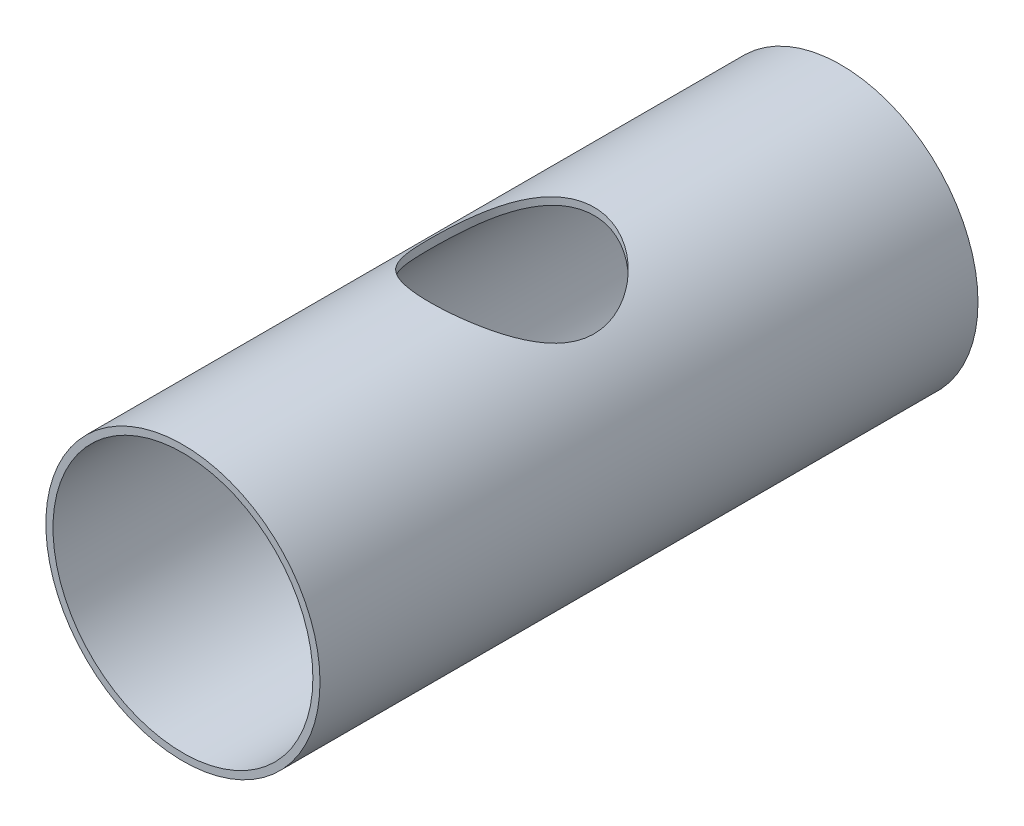
ISO-10303-21;
HEADER;
FILE_DESCRIPTION(('STEP AP214'),'2;1');
FILE_NAME('part.step','',(''),(''),'','','');
FILE_SCHEMA(('AUTOMOTIVE_DESIGN { 1 0 10303 214 1 1 1 1 }'));
ENDSEC;
DATA;
#1=APPLICATION_CONTEXT('core data for automotive mechanical design processes');
#2=APPLICATION_PROTOCOL_DEFINITION('international standard','automotive_design',2000,#1);
#3=PRODUCT_CONTEXT('',#1,'mechanical');
#4=PRODUCT('Part','Part','',(#3));
#5=PRODUCT_RELATED_PRODUCT_CATEGORY('part','',(#4));
#6=PRODUCT_DEFINITION_FORMATION('','',#4);
#7=PRODUCT_DEFINITION_CONTEXT('part definition',#1,'design');
#8=PRODUCT_DEFINITION('design','',#6,#7);
#9=PRODUCT_DEFINITION_SHAPE('','',#8);
#10=(LENGTH_UNIT() NAMED_UNIT(*) SI_UNIT(.MILLI.,.METRE.));
#11=(NAMED_UNIT(*) PLANE_ANGLE_UNIT() SI_UNIT($,.RADIAN.));
#12=(NAMED_UNIT(*) SI_UNIT($,.STERADIAN.) SOLID_ANGLE_UNIT());
#13=UNCERTAINTY_MEASURE_WITH_UNIT(LENGTH_MEASURE(1.E-05),#10,'distance_accuracy_value','');
#14=(GEOMETRIC_REPRESENTATION_CONTEXT(3) GLOBAL_UNCERTAINTY_ASSIGNED_CONTEXT((#13)) GLOBAL_UNIT_ASSIGNED_CONTEXT((#10,
#11,#12)) REPRESENTATION_CONTEXT('',''));
#15=CARTESIAN_POINT('',(0.,0.,0.));
#16=DIRECTION('',(0.,0.,1.));
#17=DIRECTION('',(1.,0.,0.));
#18=AXIS2_PLACEMENT_3D('',#15,#16,#17);
#19=CARTESIAN_POINT('',(0.,0.,0.));
#20=DIRECTION('',(0.,0.,1.));
#21=DIRECTION('',(1.,0.,0.));
#22=AXIS2_PLACEMENT_3D('',#19,#20,#21);
#23=CYLINDRICAL_SURFACE('',#22,30.099);
#24=CARTESIAN_POINT('',(0.,0.,0.));
#25=DIRECTION('',(0.,0.,1.));
#26=DIRECTION('',(1.,0.,0.));
#27=AXIS2_PLACEMENT_3D('',#24,#25,#26);
#28=CIRCLE('',#27,30.099);
#29=CARTESIAN_POINT('',(30.099,0.,0.));
#30=VERTEX_POINT('',#29);
#31=EDGE_CURVE('E53',#30,#30,#28,.T.);
#32=ORIENTED_EDGE('',*,*,#31,.F.);
#33=EDGE_LOOP('',(#32));
#34=FACE_BOUND('',#33,.T.);
#35=CARTESIAN_POINT('',(-19.05,23.3033753134605,76.2));
#36=CARTESIAN_POINT('',(-19.0499964286924,23.3033811096579,76.6720435458902));
#37=CARTESIAN_POINT('',(-19.0324211372841,23.3177796485911,77.1441439223114));
#38=CARTESIAN_POINT('',(-18.9624498991082,23.3747141684592,78.0842434430483));
#39=CARTESIAN_POINT('',(-18.9100351542867,23.4172653394344,78.5522402350307));
#40=CARTESIAN_POINT('',(-18.7712148429126,23.5286887195718,79.4810003771917));
#41=CARTESIAN_POINT('',(-18.6847351836268,23.5976182935843,79.9417456679059));
#42=CARTESIAN_POINT('',(-18.4792431160487,23.7588798978588,80.8516277262143));
#43=CARTESIAN_POINT('',(-18.3602335385331,23.8512098917487,81.3007655001823));
#44=CARTESIAN_POINT('',(-18.0925388847279,24.0548919093312,82.1809942461394));
#45=CARTESIAN_POINT('',(-17.9441296839205,24.16606580454,82.6122109946506));
#46=CARTESIAN_POINT('',(-17.6185656699363,24.4044386521597,83.4590983494921));
#47=CARTESIAN_POINT('',(-17.4414066282712,24.5316399612449,83.8747666578958));
#48=CARTESIAN_POINT('',(-17.0598732510647,24.7984815741484,84.6891340683467));
#49=CARTESIAN_POINT('',(-16.8555036749214,24.9381197012303,85.0878361219068));
#50=CARTESIAN_POINT('',(-16.4208141852716,25.2264681438916,85.8673968238354));
#51=CARTESIAN_POINT('',(-16.1904927071825,25.3751790061978,86.2482543944377));
#52=CARTESIAN_POINT('',(-15.6714656758414,25.6994366551252,87.0426374919245));
#53=CARTESIAN_POINT('',(-15.3790897113264,25.8758537957221,87.4534132828229));
#54=CARTESIAN_POINT('',(-14.7635061022875,26.2319490904412,88.2496748734941));
#55=CARTESIAN_POINT('',(-14.4402964745316,26.4116274537237,88.635159043806));
#56=CARTESIAN_POINT('',(-13.7639347985054,26.7703294712885,89.3799017296586));
#57=CARTESIAN_POINT('',(-13.4107581635878,26.9493524597719,89.7391382515408));
#58=CARTESIAN_POINT('',(-12.6757931980663,27.3027538777893,90.4295822457694));
#59=CARTESIAN_POINT('',(-12.2940031784151,27.4771320323141,90.7607880610029));
#60=CARTESIAN_POINT('',(-11.4534348202648,27.8388808198039,91.4330568536948));
#61=CARTESIAN_POINT('',(-10.9910012644315,28.0251461342588,91.770165637626));
#62=CARTESIAN_POINT('',(-10.0333435426301,28.3820885917296,92.4038319929742));
#63=CARTESIAN_POINT('',(-9.5381159482412,28.5527641004722,92.7003853145947));
#64=CARTESIAN_POINT('',(-8.51791666418115,28.8735268344577,93.2494237247363));
#65=CARTESIAN_POINT('',(-7.9929680844138,29.0236297537365,93.5019424460616));
#66=CARTESIAN_POINT('',(-6.91654377805485,29.2987986944928,93.9596669877427));
#67=CARTESIAN_POINT('',(-6.36507305357348,29.4238694142862,94.1648816877317));
#68=CARTESIAN_POINT('',(-5.2984798575911,29.6334268689036,94.505978039931));
#69=CARTESIAN_POINT('',(-4.78551094288429,29.7207757862651,94.6468401457226));
#70=CARTESIAN_POINT('',(-3.74597713522144,29.869600241993,94.8856754058247));
#71=CARTESIAN_POINT('',(-3.21941309676931,29.9310774023136,94.9836512487797));
#72=CARTESIAN_POINT('',(-2.15790631094233,30.0262711064919,95.1349706269843));
#73=CARTESIAN_POINT('',(-1.62297160754452,30.0600128121571,95.1883546170029));
#74=CARTESIAN_POINT('',(-0.54948910942336,30.0987738982047,95.2496581394133));
#75=CARTESIAN_POINT('',(-0.0109417547668578,30.1037967155155,95.2575831121058));
#76=CARTESIAN_POINT('',(0.990244783798888,30.0862821371761,95.2299005137296));
#77=CARTESIAN_POINT('',(1.4531248112464,30.0674446012371,95.200137197032));
#78=CARTESIAN_POINT('',(2.37412115481649,30.0087685977492,95.1071469094217));
#79=CARTESIAN_POINT('',(2.83223801458744,29.968932554321,95.0439238011883));
#80=CARTESIAN_POINT('',(3.74054000559729,29.8691639490416,94.8848463508602));
#81=CARTESIAN_POINT('',(4.19072481141623,29.8092305646893,94.788990673247));
#82=CARTESIAN_POINT('',(5.08026831205507,29.6705802160046,94.5658288569096));
#83=CARTESIAN_POINT('',(5.51962654739728,29.5918624559762,94.4385213858963));
#84=CARTESIAN_POINT('',(6.38555098588612,29.4171703467752,94.1536980587));
#85=CARTESIAN_POINT('',(6.8120994338097,29.3211732287649,93.9961423262216));
#86=CARTESIAN_POINT('',(7.64966554255798,29.113889514145,93.6525080559975));
#87=CARTESIAN_POINT('',(8.06068340803638,29.0026031190989,93.4664298942687));
#88=CARTESIAN_POINT('',(8.86549194668315,28.766798746861,93.067344990583));
#89=CARTESIAN_POINT('',(9.25928144231839,28.642279867237,92.8543364118311));
#90=CARTESIAN_POINT('',(10.028246699608,28.3821926176968,92.4029498148767));
#91=CARTESIAN_POINT('',(10.40342038548,28.2466230199888,92.1645689767836));
#92=CARTESIAN_POINT('',(11.1800151037953,27.9490790761088,91.6323802341892));
#93=CARTESIAN_POINT('',(11.5787952042619,27.7859291089016,91.3353725015932));
#94=CARTESIAN_POINT('',(12.3500239248784,27.4518371302508,90.7129261864017));
#95=CARTESIAN_POINT('',(12.7224706534113,27.2808945604852,90.38748556512));
#96=CARTESIAN_POINT('',(13.4404258796066,26.934435829275,89.7093165150629));
#97=CARTESIAN_POINT('',(13.7858963307524,26.758913657995,89.3565508955938));
#98=CARTESIAN_POINT('',(14.448288071092,26.4071472753367,88.6254902889073));
#99=CARTESIAN_POINT('',(14.7652079459559,26.2309030286401,88.247194038583));
#100=CARTESIAN_POINT('',(15.4103339062582,25.8578490947492,87.4133121177501));
#101=CARTESIAN_POINT('',(15.7342552937249,25.6614869478261,86.9541977396843));
#102=CARTESIAN_POINT('',(16.342014764231,25.2787928239379,86.0060284063711));
#103=CARTESIAN_POINT('',(16.6258450205764,25.0924628098533,85.516967631551));
#104=CARTESIAN_POINT('',(17.1506240797184,24.7367388622229,84.5114224206472));
#105=CARTESIAN_POINT('',(17.3916358121512,24.5673202375927,83.9949797024232));
#106=CARTESIAN_POINT('',(17.8283743125202,24.2522464416436,82.9363962503076));
#107=CARTESIAN_POINT('',(18.0241208387135,24.1065809103199,82.3942668536324));
#108=CARTESIAN_POINT('',(18.3212470844933,23.881092121581,81.4358777391786));
#109=CARTESIAN_POINT('',(18.4338616133664,23.7940809956612,81.0247631532689));
#110=CARTESIAN_POINT('',(18.6318453565921,23.639373135442,80.1924567514692));
#111=CARTESIAN_POINT('',(18.7172190042562,23.5716732585278,79.7712665873333));
#112=CARTESIAN_POINT('',(18.859480100837,23.4580076706048,78.9217203565746));
#113=CARTESIAN_POINT('',(18.9164024520992,23.4120153339661,78.4933737393401));
#114=CARTESIAN_POINT('',(19.0010372336403,23.3433797745503,77.6319138573384));
#115=CARTESIAN_POINT('',(19.0287492595379,23.3207368750179,77.1988005266657));
#116=CARTESIAN_POINT('',(19.054526988174,23.2996800503784,76.3299472405899));
#117=CARTESIAN_POINT('',(19.0525140406314,23.3013304035481,75.8942033673653));
#118=CARTESIAN_POINT('',(19.0186853972974,23.3289492165018,75.0246574232265));
#119=CARTESIAN_POINT('',(18.986869535715,23.3549178115662,74.590855363128));
#120=CARTESIAN_POINT('',(18.8939372678199,23.4301618600023,73.7281550451951));
#121=CARTESIAN_POINT('',(18.8327997515817,23.4794541047335,73.2992605486563));
#122=CARTESIAN_POINT('',(18.6821555325241,23.5994937813449,72.4495643646723));
#123=CARTESIAN_POINT('',(18.5926481631025,23.6702417173647,72.0287628676337));
#124=CARTESIAN_POINT('',(18.388770079443,23.8289574237033,71.206915303451));
#125=CARTESIAN_POINT('',(18.2749996169301,23.9165050999748,70.8056379073538));
#126=CARTESIAN_POINT('',(18.022655349524,24.1072332794926,70.0146278996121));
#127=CARTESIAN_POINT('',(17.8840717692126,24.2104199414317,69.6248999087744));
#128=CARTESIAN_POINT('',(17.583332854521,24.4297117736263,68.8584478624991));
#129=CARTESIAN_POINT('',(17.4211785086641,24.5458164020734,68.481723262538));
#130=CARTESIAN_POINT('',(17.0743815818836,24.788305035742,67.7421729405572));
#131=CARTESIAN_POINT('',(16.889736017595,24.9146904039199,67.3793490708196));
#132=CARTESIAN_POINT('',(16.4612088452912,25.2003345228271,66.5997223936424));
#133=CARTESIAN_POINT('',(16.2127726627587,25.361229950127,66.1860173304886));
#134=CARTESIAN_POINT('',(15.686700080151,25.6899487113834,65.380508673736));
#135=CARTESIAN_POINT('',(15.4090609892964,25.8577726828746,64.9887071034454));
#136=CARTESIAN_POINT('',(14.825488634821,26.1967296498121,64.2276346607233));
#137=CARTESIAN_POINT('',(14.5195289306607,26.3678656170798,63.8583853881975));
#138=CARTESIAN_POINT('',(13.880557218281,26.7097597135681,63.1438763909316));
#139=CARTESIAN_POINT('',(13.5475434255937,26.8805178171007,62.7986182514204));
#140=CARTESIAN_POINT('',(12.7962561398225,27.2471805743538,62.0764668621553));
#141=CARTESIAN_POINT('',(12.3731357009786,27.442398189211,61.7042440002966));
#142=CARTESIAN_POINT('',(11.4926798845175,27.8226183261844,60.9967181964356));
#143=CARTESIAN_POINT('',(11.035340329937,28.0076195964343,60.6614197740103));
#144=CARTESIAN_POINT('',(10.0885120841335,28.3624262011295,60.0306496844473));
#145=CARTESIAN_POINT('',(9.59903056983751,28.5322349080269,59.7351691711034));
#146=CARTESIAN_POINT('',(8.59039635818776,28.8519436785586,59.1871554607208));
#147=CARTESIAN_POINT('',(8.07124726177851,29.00184615103,58.9346170662522));
#148=CARTESIAN_POINT('',(7.03554973090195,29.2698003004733,58.4883093369697));
#149=CARTESIAN_POINT('',(6.52039118737631,29.3891396057806,58.2920932154876));
#150=CARTESIAN_POINT('',(5.47020297849929,29.6025958794029,57.9438963383099));
#151=CARTESIAN_POINT('',(4.93517367291943,29.6967133041214,57.7919147821619));
#152=CARTESIAN_POINT('',(3.85049447586942,29.8567185002272,57.5348868708586));
#153=CARTESIAN_POINT('',(3.30086327582684,29.9226406736211,57.4297833114832));
#154=CARTESIAN_POINT('',(2.19176692945456,30.024254304336,57.2682139103586));
#155=CARTESIAN_POINT('',(1.63230354893124,30.0599511344597,57.2117394243623));
#156=CARTESIAN_POINT('',(0.594916187995177,30.0968931274945,57.1533194641563));
#157=CARTESIAN_POINT('',(0.117525944318277,30.1025507062547,57.1443895719722));
#158=CARTESIAN_POINT('',(-0.836270296196084,30.0911583552341,57.162390472571));
#159=CARTESIAN_POINT('',(-1.31267640606509,30.0741111972264,57.189316888049));
#160=CARTESIAN_POINT('',(-2.26077018898116,30.0177325377784,57.2786322914825));
#161=CARTESIAN_POINT('',(-2.73245815208587,29.978402414904,57.3410190856339));
#162=CARTESIAN_POINT('',(-3.66764925065178,29.8784086364232,57.5003783680276));
#163=CARTESIAN_POINT('',(-4.13115224614397,29.8177446163617,57.5973514471209));
#164=CARTESIAN_POINT('',(-5.02781632609349,29.6794222164113,57.819900249112));
#165=CARTESIAN_POINT('',(-5.46143920811129,29.6025711922271,57.9441259248664));
#166=CARTESIAN_POINT('',(-6.31579265977216,29.4321305816411,58.2218181397335));
#167=CARTESIAN_POINT('',(-6.73652379156096,29.3385417263139,58.3752834017396));
#168=CARTESIAN_POINT('',(-7.56308082731033,29.1364145522204,58.709970276366));
#169=CARTESIAN_POINT('',(-7.96890604234098,29.0278755435782,58.8911931699077));
#170=CARTESIAN_POINT('',(-8.76397048251598,28.7978111986365,59.2798593848632));
#171=CARTESIAN_POINT('',(-9.15320865202343,28.6762850375266,59.4873043717877));
#172=CARTESIAN_POINT('',(-9.95235497632018,28.4094250380874,59.9492397043657));
#173=CARTESIAN_POINT('',(-10.3603498410292,28.262926732155,60.2063681106474));
#174=CARTESIAN_POINT('',(-11.1531154279581,27.9595778022842,60.7487465798841));
#175=CARTESIAN_POINT('',(-11.5378848438405,27.802726597074,61.0339982222854));
#176=CARTESIAN_POINT('',(-12.2833992715147,27.4814992476887,61.6312338566716));
#177=CARTESIAN_POINT('',(-12.6441207184945,27.3171159813177,61.943243404006));
#178=CARTESIAN_POINT('',(-13.3401594402803,26.9840478058006,62.5923135791915));
#179=CARTESIAN_POINT('',(-13.675474656682,26.8153625495855,62.9293762324636));
#180=CARTESIAN_POINT('',(-14.367759611611,26.4516923474389,63.6793070716943));
#181=CARTESIAN_POINT('',(-14.7205179441443,26.2565317686574,64.0959891682694));
#182=CARTESIAN_POINT('',(-15.3898113254652,25.8699228902264,64.9592454379339));
#183=CARTESIAN_POINT('',(-15.7063397897492,25.6784752706135,65.4058250213646));
#184=CARTESIAN_POINT('',(-16.3012954840708,25.304958197376,66.3272621904715));
#185=CARTESIAN_POINT('',(-16.579731990894,25.1228864671389,66.8021128505316));
#186=CARTESIAN_POINT('',(-17.0963882153084,24.7741889166056,67.778545748658));
#187=CARTESIAN_POINT('',(-17.3346207389446,24.6075581855922,68.2801194075029));
#188=CARTESIAN_POINT('',(-17.7212352969221,24.3300500138661,69.1963553009302));
#189=CARTESIAN_POINT('',(-17.8778958789556,24.2149216560523,69.6062502496627));
#190=CARTESIAN_POINT('',(-18.1636250341629,24.0013408937634,70.4398527834087));
#191=CARTESIAN_POINT('',(-18.2926936506077,23.9028884631365,70.8635603467594));
#192=CARTESIAN_POINT('',(-18.5214491309873,23.7260743137994,71.7217112953762));
#193=CARTESIAN_POINT('',(-18.6212138302502,23.6476594459772,72.1561228566733));
#194=CARTESIAN_POINT('',(-18.7904044752206,23.5134476216519,73.0341048936675));
#195=CARTESIAN_POINT('',(-18.8598448802788,23.4576398864466,73.4776708984088));
#196=CARTESIAN_POINT('',(-18.9588603619197,23.3776552466743,74.3005825483146));
#197=CARTESIAN_POINT('',(-18.9929925193618,23.3498802048867,74.6790361319625));
#198=CARTESIAN_POINT('',(-19.0385668542472,23.3127354055649,75.438313735502));
#199=CARTESIAN_POINT('',(-19.0500028814588,23.3033706368809,75.8191383698677));
#200=CARTESIAN_POINT('',(-19.05,23.3033753134605,76.2));
#201=B_SPLINE_CURVE_WITH_KNOTS('',3,(#35,#36,#37,#38,#39,#40,#41,#42,#43,#44,#45,#46,#47,#48,
#49,#50,#51,#52,#53,#54,#55,#56,#57,#58,#59,#60,#61,#62,#63,#64,#65,#66,#67,#68,#69,#70,#71,#72,
#73,#74,#75,#76,#77,#78,#79,#80,#81,#82,#83,#84,#85,#86,#87,#88,#89,#90,#91,#92,#93,#94,#95,#96,
#97,#98,#99,#100,#101,#102,#103,#104,#105,#106,#107,#108,#109,#110,#111,#112,#113,#114,#115,
#116,#117,#118,#119,#120,#121,#122,#123,#124,#125,#126,#127,#128,#129,#130,#131,#132,#133,#134,
#135,#136,#137,#138,#139,#140,#141,#142,#143,#144,#145,#146,#147,#148,#149,#150,#151,#152,#153,
#154,#155,#156,#157,#158,#159,#160,#161,#162,#163,#164,#165,#166,#167,#168,#169,#170,#171,#172,
#173,#174,#175,#176,#177,#178,#179,#180,#181,#182,#183,#184,#185,#186,#187,#188,#189,#190,#191,
#192,#193,#194,#195,#196,#197,#198,#199,#200),.UNSPECIFIED.,.T.,.F.,(4,2,2,2,2,2,2,2,2,2,2,2,2,
2,2,2,2,2,2,2,2,2,2,2,2,2,2,2,2,2,2,2,2,2,2,2,2,2,2,2,2,2,2,2,2,2,2,2,2,2,2,2,2,2,2,2,2,2,2,2,2,
2,2,2,2,2,2,2,2,2,2,2,2,2,2,2,2,2,2,2,2,2,4),(0.,1.41569215269219,2.83214878016572,
4.25170342920977,5.67113458689961,7.07782851023648,8.48472951606649,9.89138476314508,
11.2981248597705,12.8990894694518,14.5001571232527,16.1025513273082,17.705040195265,
19.5080871012545,21.3113228035342,23.1131751375744,24.9146889625365,26.5295584971442,
28.1443267771328,29.7576285056725,31.3707371585538,32.7617172076984,34.1525367137531,
35.5434131472449,36.9343485079703,38.3271302894018,39.7198937110948,41.1127521778283,
42.5057656097933,44.0741321929524,45.6426113230768,47.2132640658329,48.783994572379,
50.5674590501575,52.3512712206839,54.1324396667877,55.9128291592872,57.2167203007411,
58.5203991323389,59.8224747394466,61.1245683719662,62.4301078725946,63.7356546358705,
65.0421427328215,66.3486615304089,67.625986647871,68.9038160942102,70.1815919657184,
71.4595375137419,72.9841392160606,74.5088815196683,76.0350619860664,77.5613432000765,
79.3483410670241,81.1355574212115,82.9223760588365,84.7089782775825,86.3985546762302,
88.0881004990283,89.7755789262698,91.4627573273647,92.8934487220843,94.3239654753304,
95.7543937373699,97.1848464371526,98.5560905119798,99.9272747082688,101.298522199165,
102.6698568294,104.180411644429,105.691051343034,107.203150209049,108.715371454098,
110.452789904363,112.190523617553,113.927833372753,115.664588699501,117.024355753937,
118.384120675909,119.740240515354,121.095713016404,122.237634723975,123.379865828995),.UNSPECIFIED.);
#202=CARTESIAN_POINT('',(-19.05,23.3033753134605,76.2));
#203=VERTEX_POINT('',#202);
#204=EDGE_CURVE('E55',#203,#203,#201,.T.);
#205=ORIENTED_EDGE('',*,*,#204,.T.);
#206=EDGE_LOOP('',(#205));
#207=FACE_BOUND('',#206,.T.);
#208=CARTESIAN_POINT('',(0.,0.,152.4));
#209=DIRECTION('',(0.,0.,1.));
#210=DIRECTION('',(1.,0.,0.));
#211=AXIS2_PLACEMENT_3D('',#208,#209,#210);
#212=CIRCLE('',#211,30.099);
#213=CARTESIAN_POINT('',(30.099,0.,152.4));
#214=VERTEX_POINT('',#213);
#215=EDGE_CURVE('E18',#214,#214,#212,.T.);
#216=ORIENTED_EDGE('',*,*,#215,.T.);
#217=EDGE_LOOP('',(#216));
#218=FACE_BOUND('',#217,.T.);
#219=ADVANCED_FACE('F14',(#34,#207,#218),#23,.F.);
#220=CARTESIAN_POINT('',(0.,0.,152.4));
#221=DIRECTION('',(0.,0.,-1.));
#222=DIRECTION('',(-1.,0.,0.));
#223=AXIS2_PLACEMENT_3D('',#220,#221,#222);
#224=PLANE('',#223);
#225=ORIENTED_EDGE('',*,*,#215,.F.);
#226=EDGE_LOOP('',(#225));
#227=FACE_BOUND('',#226,.T.);
#228=CARTESIAN_POINT('',(0.,0.,152.4));
#229=DIRECTION('',(0.,0.,1.));
#230=DIRECTION('',(1.,0.,0.));
#231=AXIS2_PLACEMENT_3D('',#228,#229,#230);
#232=CIRCLE('',#231,31.75);
#233=CARTESIAN_POINT('',(31.75,0.,152.4));
#234=VERTEX_POINT('',#233);
#235=EDGE_CURVE('E27',#234,#234,#232,.F.);
#236=ORIENTED_EDGE('',*,*,#235,.F.);
#237=EDGE_LOOP('',(#236));
#238=FACE_BOUND('',#237,.T.);
#239=ADVANCED_FACE('F48',(#227,#238),#224,.F.);
#240=CARTESIAN_POINT('',(0.,0.,76.2));
#241=DIRECTION('',(0.,1.,0.));
#242=DIRECTION('',(0.,0.,1.));
#243=AXIS2_PLACEMENT_3D('',#240,#241,#242);
#244=CYLINDRICAL_SURFACE('',#243,19.05);
#245=CARTESIAN_POINT('',(-19.05,25.4,76.2));
#246=CARTESIAN_POINT('',(-19.0500030433361,25.3999955153607,75.7207204330967));
#247=CARTESIAN_POINT('',(-19.0318866360528,25.4136147540335,75.2414746306685));
#248=CARTESIAN_POINT('',(-18.9597665350224,25.4674651224366,74.2872383176848));
#249=CARTESIAN_POINT('',(-18.9057652305025,25.5076944804563,73.8122475259633));
#250=CARTESIAN_POINT('',(-18.7627494822322,25.6130742857092,72.8699732174259));
#251=CARTESIAN_POINT('',(-18.6737030437178,25.6782475041595,72.4026971511663));
#252=CARTESIAN_POINT('',(-18.4619724308095,25.8308935009143,71.4795797342927));
#253=CARTESIAN_POINT('',(-18.3392864978997,25.9183674449799,71.0237389828238));
#254=CARTESIAN_POINT('',(-18.0629336190988,26.1117043683075,70.1295556089565));
#255=CARTESIAN_POINT('',(-17.9095082615041,26.2174231109637,69.691106637458));
#256=CARTESIAN_POINT('',(-17.5726349051003,26.4443990783738,68.8298618265442));
#257=CARTESIAN_POINT('',(-17.3891732018061,26.5656633904963,68.4070732408728));
#258=CARTESIAN_POINT('',(-16.9937712169076,26.820319162003,67.5788129205788));
#259=CARTESIAN_POINT('',(-16.781828246272,26.953711766083,67.1733428258342));
#260=CARTESIAN_POINT('',(-16.330912657735,27.2292780908344,66.3810637945362));
#261=CARTESIAN_POINT('',(-16.0919483062903,27.3714491199758,65.994249202219));
#262=CARTESIAN_POINT('',(-15.5572378583988,27.6792572858929,65.1939120927282));
#263=CARTESIAN_POINT('',(-15.2581219656944,27.8456355108008,64.7829228268499));
#264=CARTESIAN_POINT('',(-14.6287095322507,28.1813874604145,63.9868570510936));
#265=CARTESIAN_POINT('',(-14.298411196638,28.3507613570958,63.6017820350376));
#266=CARTESIAN_POINT('',(-13.6076982827149,28.6886903739352,62.8586911030127));
#267=CARTESIAN_POINT('',(-13.2472625347916,28.8572448290386,62.5006945499027));
#268=CARTESIAN_POINT('',(-12.4977451309368,29.1896722320412,61.8136404180361));
#269=CARTESIAN_POINT('',(-12.1086620152075,29.3535449407788,61.4845843158897));
#270=CARTESIAN_POINT('',(-11.2595802475687,29.6903153352943,60.8232523223434));
#271=CARTESIAN_POINT('',(-10.7964639969312,29.8622702847622,60.4944822958443));
#272=CARTESIAN_POINT('',(-9.83886050405454,30.1913173077929,59.8775083570895));
#273=CARTESIAN_POINT('',(-9.34437041671311,30.3484080301821,59.5893081315118));
#274=CARTESIAN_POINT('',(-8.32717825497414,30.6431189858679,59.056782942697));
#275=CARTESIAN_POINT('',(-7.80449618105845,30.7807527780531,58.8124273932694));
#276=CARTESIAN_POINT('',(-6.73423397947851,31.0324765938135,58.370597646227));
#277=CARTESIAN_POINT('',(-6.1866579610843,31.1465704860484,58.173115744369));
#278=CARTESIAN_POINT('',(-5.12438295057635,31.3379336812043,57.844560971356));
#279=CARTESIAN_POINT('',(-4.61153213595369,31.4176778878727,57.7089495642807));
#280=CARTESIAN_POINT('',(-3.57318880894903,31.5526353007049,57.4805634318588));
#281=CARTESIAN_POINT('',(-3.04769703134714,31.6078499290826,57.3877862229923));
#282=CARTESIAN_POINT('',(-1.9891166531179,31.6920750951087,57.2466142442577));
#283=CARTESIAN_POINT('',(-1.45603433366252,31.7211061498543,57.1981847236794));
#284=CARTESIAN_POINT('',(-0.386919923557409,31.752144276032,57.1464146133016));
#285=CARTESIAN_POINT('',(0.149111861425052,31.7541540969336,57.1430694360717));
#286=CARTESIAN_POINT('',(1.15245851538247,31.7325396230811,57.1791115748801));
#287=CARTESIAN_POINT('',(1.62004164049625,31.7120672053353,57.2132445794103));
#288=CARTESIAN_POINT('',(2.5500697924503,31.650857053637,57.3156560089528));
#289=CARTESIAN_POINT('',(3.01251534364243,31.6101214075842,57.3839309160264));
#290=CARTESIAN_POINT('',(3.92910214406089,31.5093204998608,57.5537687450717));
#291=CARTESIAN_POINT('',(4.38324309499943,31.4492545453123,57.6553328602681));
#292=CARTESIAN_POINT('',(5.28032954094567,31.3111259818363,57.8905579534865));
#293=CARTESIAN_POINT('',(5.72327457382188,31.2330626313758,58.0242202540349));
#294=CARTESIAN_POINT('',(6.5979086194758,31.0601027353735,58.3230620697935));
#295=CARTESIAN_POINT('',(7.02951910170976,30.9651127965082,58.4884168535475));
#296=CARTESIAN_POINT('',(7.87666129255269,30.7605365403226,58.8485572351959));
#297=CARTESIAN_POINT('',(8.29219315214076,30.6509503601047,59.0433425566518));
#298=CARTESIAN_POINT('',(9.10543882125585,30.41927480587,59.4607520602));
#299=CARTESIAN_POINT('',(9.50315052514601,30.297183959868,59.6833795204099));
#300=CARTESIAN_POINT('',(10.2792682203324,30.0427357333896,60.154895884795));
#301=CARTESIAN_POINT('',(10.6576721934951,29.9103772833251,60.403787525916));
#302=CARTESIAN_POINT('',(11.4379301949245,29.621433930928,60.9575710495181));
#303=CARTESIAN_POINT('',(11.8371872371042,29.4638435892315,61.2656009557293));
#304=CARTESIAN_POINT('',(12.6085455534525,29.1420959420027,61.9108443607676));
#305=CARTESIAN_POINT('',(12.9806449534989,28.9779381844672,62.2480598701613));
#306=CARTESIAN_POINT('',(13.6968786255124,28.6463599537303,62.9504744323439));
#307=CARTESIAN_POINT('',(14.0409765873179,28.4789355825341,63.3157086626127));
#308=CARTESIAN_POINT('',(14.699450524442,28.1447153898072,64.0723372066896));
#309=CARTESIAN_POINT('',(15.013825126744,27.9779195976538,64.463732727547));
#310=CARTESIAN_POINT('',(15.6462416757809,27.6297405148073,65.3182722040128));
#311=CARTESIAN_POINT('',(15.9604754929598,27.4489106330544,65.7844714467649));
#312=CARTESIAN_POINT('',(16.5482192816269,27.0986352704548,66.7460855803186));
#313=CARTESIAN_POINT('',(16.8217225567256,26.9291916640998,67.2415052565157));
#314=CARTESIAN_POINT('',(17.3250854321619,26.6081364749748,68.2586277338089));
#315=CARTESIAN_POINT('',(17.5550104317681,26.4564983032785,68.7802896393145));
#316=CARTESIAN_POINT('',(17.9688068894371,26.1772209542224,69.8476951430643));
#317=CARTESIAN_POINT('',(18.1526964388409,26.0495723542007,70.3934291817844));
#318=CARTESIAN_POINT('',(18.4319495615749,25.8524125545377,71.3672979590642));
#319=CARTESIAN_POINT('',(18.5379584002604,25.7763326818504,71.791077051665));
#320=CARTESIAN_POINT('',(18.7210165227704,25.643690535517,72.6478433911075));
#321=CARTESIAN_POINT('',(18.7980704306926,25.5871251455295,73.0808291559656));
#322=CARTESIAN_POINT('',(18.922127063626,25.4955206448321,73.9529150552301));
#323=CARTESIAN_POINT('',(18.9691595595826,25.4604602099343,74.3920086896994));
#324=CARTESIAN_POINT('',(19.0325954900872,25.4130752797588,75.2736516927219));
#325=CARTESIAN_POINT('',(19.0489982750633,25.4007512666581,75.7162011343634));
#326=CARTESIAN_POINT('',(19.0509139507491,25.3993145638977,76.6020140356642));
#327=CARTESIAN_POINT('',(19.0363843182632,25.4102338270689,77.0452776401009));
#328=CARTESIAN_POINT('',(18.976579327398,25.4549270881926,77.9285511952995));
#329=CARTESIAN_POINT('',(18.9313038088751,25.4887012051874,78.3685611291023));
#330=CARTESIAN_POINT('',(18.8106484879804,25.5778733498461,79.2424883758321));
#331=CARTESIAN_POINT('',(18.7352484622474,25.6332859033863,79.6764013927622));
#332=CARTESIAN_POINT('',(18.5553697154487,25.763793740709,80.535115484738));
#333=CARTESIAN_POINT('',(18.4508901774936,25.8388895774225,80.9599163034466));
#334=CARTESIAN_POINT('',(18.2142746755105,26.0062228871101,81.7974813764668));
#335=CARTESIAN_POINT('',(18.082183344594,26.098432669582,82.2102638457889));
#336=CARTESIAN_POINT('',(17.7914785230302,26.2974677827158,83.0229112975058));
#337=CARTESIAN_POINT('',(17.6328543746093,26.4042989834013,83.4227710117305));
#338=CARTESIAN_POINT('',(17.2903780323563,26.6298205836189,84.2080476875093));
#339=CARTESIAN_POINT('',(17.1065257945903,26.7485110038033,84.5934646239102));
#340=CARTESIAN_POINT('',(16.7147386736214,26.9950660056724,85.3488291194828));
#341=CARTESIAN_POINT('',(16.5068009012868,27.1229316872558,85.7187748155739));
#342=CARTESIAN_POINT('',(16.0282943945507,27.4088910207598,86.5075560117898));
#343=CARTESIAN_POINT('',(15.7531930567334,27.5682779790784,86.9231794367178));
#344=CARTESIAN_POINT('',(15.1723686976129,27.8921550356589,87.7303512985581));
#345=CARTESIAN_POINT('',(14.8666429050975,28.0566455948153,88.1218975515395));
#346=CARTESIAN_POINT('',(14.2255899583731,28.3870607601772,88.8799720353113));
#347=CARTESIAN_POINT('',(13.8902371111873,28.5529864962553,89.2464780526892));
#348=CARTESIAN_POINT('',(13.1913594057947,28.8825175939573,89.9527221236886));
#349=CARTESIAN_POINT('',(12.827833090152,29.0461228350215,90.2924587906746));
#350=CARTESIAN_POINT('',(12.0246635150632,29.388509400508,90.9860386179969));
#351=CARTESIAN_POINT('',(11.5812733203869,29.5664917627542,91.335955294987));
#352=CARTESIAN_POINT('',(10.6619473117135,29.9103031736974,91.9970228337117));
#353=CARTESIAN_POINT('',(10.1860081741397,30.0761309776986,92.3081697274771));
#354=CARTESIAN_POINT('',(9.20424187123935,30.3909526577893,92.8886015062215));
#355=CARTESIAN_POINT('',(8.69842915212207,30.5399545706269,93.1579063999895));
#356=CARTESIAN_POINT('',(7.65982987403192,30.8168491407146,93.651646948858));
#357=CARTESIAN_POINT('',(7.12704700493558,30.9447446754539,93.8760887211514));
#358=CARTESIAN_POINT('',(6.07798561942446,31.1670798024325,94.2623903353338));
#359=CARTESIAN_POINT('',(5.56331752885066,31.2632743046728,94.4276108788632));
#360=CARTESIAN_POINT('',(4.51804744185828,31.4313513049915,94.7144097560175));
#361=CARTESIAN_POINT('',(3.98744603894439,31.5032347074212,94.8359897130437));
#362=CARTESIAN_POINT('',(2.91542418319577,31.6204564312132,95.0334696233594));
#363=CARTESIAN_POINT('',(2.37401441890704,31.6658197527149,95.1094125999361));
#364=CARTESIAN_POINT('',(1.28508673057209,31.7286672222156,95.2144714153752));
#365=CARTESIAN_POINT('',(0.737569612155827,31.7461550045296,95.2435933586037));
#366=CARTESIAN_POINT('',(-0.284885364692595,31.7522730563548,95.2537869396759));
#367=CARTESIAN_POINT('',(-0.759756226729268,31.744443586814,95.2407533666444));
#368=CARTESIAN_POINT('',(-1.70634470678995,31.7076513053243,95.1793511334469));
#369=CARTESIAN_POINT('',(-2.17806266080074,31.6786907826251,95.1309863009206));
#370=CARTESIAN_POINT('',(-3.11489424904503,31.6003310746066,94.9995664007334));
#371=CARTESIAN_POINT('',(-3.58000792933272,31.5509320318855,94.9165115751024));
#372=CARTESIAN_POINT('',(-4.50044970493062,31.4328452795982,94.7167558670913));
#373=CARTESIAN_POINT('',(-4.95577750652129,31.3641569919405,94.6000539763183));
#374=CARTESIAN_POINT('',(-5.84653134052829,31.2102800911752,94.3365055174442));
#375=CARTESIAN_POINT('',(-6.28215991922364,31.1253754869225,94.1901755234768));
#376=CARTESIAN_POINT('',(-7.13882844227936,30.9401308060231,93.8677418498051));
#377=CARTESIAN_POINT('',(-7.55986874652753,30.8397911104875,93.6916389052205));
#378=CARTESIAN_POINT('',(-8.38545490027712,30.6256191121396,93.3112027965042));
#379=CARTESIAN_POINT('',(-8.7899992869785,30.5117856162263,93.1068671358146));
#380=CARTESIAN_POINT('',(-9.58098082917176,30.2727279508239,92.6715254195633));
#381=CARTESIAN_POINT('',(-9.96741607294944,30.1475025828234,92.4405165570885));
#382=CARTESIAN_POINT('',(-10.7617380956224,29.8737772435089,91.926881477641));
#383=CARTESIAN_POINT('',(-11.167401191704,29.7242262847716,91.6413742252259));
#384=CARTESIAN_POINT('',(-11.9533450659648,29.4169699535012,91.041312123492));
#385=CARTESIAN_POINT('',(-12.3336243457184,29.259264100552,90.7267555619783));
#386=CARTESIAN_POINT('',(-13.0679111870909,28.9387770421039,90.06993425911));
#387=CARTESIAN_POINT('',(-13.4218918916796,28.7759908828684,89.7276419187843));
#388=CARTESIAN_POINT('',(-14.1019904234502,28.4488804783674,89.0171090253844));
#389=CARTESIAN_POINT('',(-14.4281066306047,28.2845561442886,88.6488669658752));
#390=CARTESIAN_POINT('',(-15.0909264819044,27.9371359141117,87.8393161651633));
#391=CARTESIAN_POINT('',(-15.4237177446674,27.7543054815336,87.3946664984531));
#392=CARTESIAN_POINT('',(-15.8937378598437,27.4860728096942,86.7056611282989));
#393=CARTESIAN_POINT('',(-16.0455616335505,27.3976569051055,86.4723003248095));
#394=CARTESIAN_POINT('',(-16.3393090002224,27.2234942548159,85.9983288144803));
#395=CARTESIAN_POINT('',(-16.4812289169821,27.1377485067197,85.7577154625282));
#396=CARTESIAN_POINT('',(-16.8914834598284,26.8857439677426,85.0257043007992));
#397=CARTESIAN_POINT('',(-17.1445294127685,26.7245927506766,84.5238184799927));
#398=CARTESIAN_POINT('',(-17.6070295650254,26.422177128707,83.4947329461344));
#399=CARTESIAN_POINT('',(-17.8164949912824,26.2809076050489,82.9675397957748));
#400=CARTESIAN_POINT('',(-18.1731747227461,26.0353808522706,81.9367011191115));
#401=CARTESIAN_POINT('',(-18.3241728048309,25.9289954135319,81.4348774978995));
#402=CARTESIAN_POINT('',(-18.5850970600308,25.7426195994241,80.4158260769868));
#403=CARTESIAN_POINT('',(-18.6950265858123,25.66262706951,79.8985995384401));
#404=CARTESIAN_POINT('',(-18.8716382770461,25.5330337901306,78.8540134853426));
#405=CARTESIAN_POINT('',(-18.9384008423901,25.4833765497646,78.3266747032852));
#406=CARTESIAN_POINT('',(-19.027577220688,25.4168642128474,77.2662095326198));
#407=CARTESIAN_POINT('',(-19.0499966150165,25.4000049880885,76.7330838808867));
#408=CARTESIAN_POINT('',(-19.05,25.4,76.2));
#409=B_SPLINE_CURVE_WITH_KNOTS('',3,(#245,#246,#247,#248,#249,#250,#251,#252,#253,#254,#255,
#256,#257,#258,#259,#260,#261,#262,#263,#264,#265,#266,#267,#268,#269,#270,#271,#272,#273,#274,
#275,#276,#277,#278,#279,#280,#281,#282,#283,#284,#285,#286,#287,#288,#289,#290,#291,#292,#293,
#294,#295,#296,#297,#298,#299,#300,#301,#302,#303,#304,#305,#306,#307,#308,#309,#310,#311,#312,
#313,#314,#315,#316,#317,#318,#319,#320,#321,#322,#323,#324,#325,#326,#327,#328,#329,#330,#331,
#332,#333,#334,#335,#336,#337,#338,#339,#340,#341,#342,#343,#344,#345,#346,#347,#348,#349,#350,
#351,#352,#353,#354,#355,#356,#357,#358,#359,#360,#361,#362,#363,#364,#365,#366,#367,#368,#369,
#370,#371,#372,#373,#374,#375,#376,#377,#378,#379,#380,#381,#382,#383,#384,#385,#386,#387,#388,
#389,#390,#391,#392,#393,#394,#395,#396,#397,#398,#399,#400,#401,#402,#403,#404,#405,#406,#407,
#408),.UNSPECIFIED.,.T.,.F.,(4,2,2,2,2,2,2,2,2,2,2,2,2,2,2,2,2,2,2,2,2,2,2,2,2,2,2,2,2,2,2,2,2,
2,2,2,2,2,2,2,2,2,2,2,2,2,2,2,2,2,2,2,2,2,2,2,2,2,2,2,2,2,2,2,2,2,2,2,2,2,2,2,2,2,2,2,2,2,2,2,2,
4),(0.,1.43725306895092,2.87441045474841,4.31288296110601,5.75143067844249,7.17908720863531,
8.60739695091145,10.0358416405457,11.4638505126248,13.0667975128927,14.6698368357259,
16.2740118067884,17.8782685792243,19.6561509342129,21.4341947456057,23.2109933240554,
24.9874996619248,26.5945007787314,28.2014087101696,29.8070563933733,31.4125406971869,
32.8186798928971,34.2246742316357,35.630718972612,37.0368216561304,38.450937395462,
39.8650398529481,41.2793089630783,42.6937255976072,44.2770713288267,45.8605262220704,
47.446002743633,49.0315524676615,50.8011018668726,52.5709418721093,54.3381044201005,
56.1045714018453,57.4334692206128,58.7621547243265,60.0895205722565,61.4169145696441,
62.7461345310084,64.0753614158315,65.4054821485047,66.7356402501381,68.0636646167326,
69.3922237144358,70.720785125821,72.0495060674693,73.6178060679859,75.1862481126681,
76.7560639393989,78.3259610282149,80.1003414399104,81.8749033051219,83.648613947926,
85.4220825758577,87.0667836502282,88.711423536449,90.3545105313319,91.997383288777,
93.4209695750303,94.844401658812,96.2678238115636,97.6912886283066,99.0917939082748,
100.492264613614,101.892859238895,103.293601388143,104.846368092805,106.39922637754,
107.95364929733,109.50816252905,111.260035617622,112.136119407803,113.012526679946,
114.76413424963,116.515290020971,118.117214395424,119.719007966836,121.317809484581,
122.916409751984),.UNSPECIFIED.);
#410=CARTESIAN_POINT('',(-19.05,25.4,76.2));
#411=VERTEX_POINT('',#410);
#412=EDGE_CURVE('E22',#411,#411,#409,.T.);
#413=ORIENTED_EDGE('',*,*,#412,.F.);
#414=EDGE_LOOP('',(#413));
#415=FACE_BOUND('',#414,.T.);
#416=ORIENTED_EDGE('',*,*,#204,.F.);
#417=EDGE_LOOP('',(#416));
#418=FACE_BOUND('',#417,.T.);
#419=ADVANCED_FACE('F35',(#415,#418),#244,.F.);
#420=CARTESIAN_POINT('',(0.,0.,0.));
#421=DIRECTION('',(0.,0.,-1.));
#422=DIRECTION('',(-1.,0.,0.));
#423=AXIS2_PLACEMENT_3D('',#420,#421,#422);
#424=PLANE('',#423);
#425=ORIENTED_EDGE('',*,*,#31,.T.);
#426=EDGE_LOOP('',(#425));
#427=FACE_BOUND('',#426,.T.);
#428=CARTESIAN_POINT('',(0.,0.,0.));
#429=DIRECTION('',(0.,0.,1.));
#430=DIRECTION('',(1.,0.,0.));
#431=AXIS2_PLACEMENT_3D('',#428,#429,#430);
#432=CIRCLE('',#431,31.75);
#433=CARTESIAN_POINT('',(31.75,0.,0.));
#434=VERTEX_POINT('',#433);
#435=EDGE_CURVE('E10',#434,#434,#432,.T.);
#436=ORIENTED_EDGE('',*,*,#435,.F.);
#437=EDGE_LOOP('',(#436));
#438=FACE_BOUND('',#437,.T.);
#439=ADVANCED_FACE('F41',(#427,#438),#424,.T.);
#440=CARTESIAN_POINT('',(0.,0.,0.));
#441=DIRECTION('',(0.,0.,1.));
#442=DIRECTION('',(1.,0.,0.));
#443=AXIS2_PLACEMENT_3D('',#440,#441,#442);
#444=CYLINDRICAL_SURFACE('',#443,31.75);
#445=ORIENTED_EDGE('',*,*,#435,.T.);
#446=EDGE_LOOP('',(#445));
#447=FACE_BOUND('',#446,.T.);
#448=ORIENTED_EDGE('',*,*,#412,.T.);
#449=EDGE_LOOP('',(#448));
#450=FACE_BOUND('',#449,.T.);
#451=ORIENTED_EDGE('',*,*,#235,.T.);
#452=EDGE_LOOP('',(#451));
#453=FACE_BOUND('',#452,.T.);
#454=ADVANCED_FACE('F38',(#447,#450,#453),#444,.T.);
#455=CLOSED_SHELL('',(#219,#239,#419,#439,#454));
#456=MANIFOLD_SOLID_BREP('B1',#455);
#457=ADVANCED_BREP_SHAPE_REPRESENTATION('',(#18,#456),#14);
#458=SHAPE_DEFINITION_REPRESENTATION(#9,#457);
ENDSEC;
END-ISO-10303-21;
